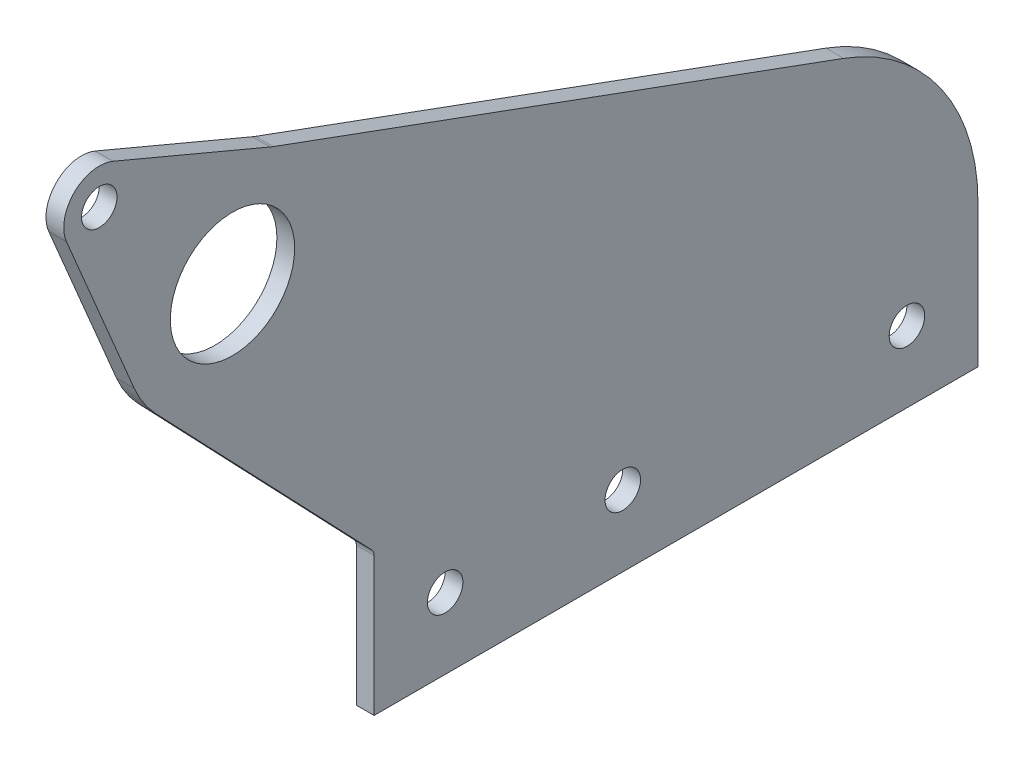
ISO-10303-21;
HEADER;
FILE_DESCRIPTION(('STEP AP214'),'2;1');
FILE_NAME('part.step','',(''),(''),'','','');
FILE_SCHEMA(('AUTOMOTIVE_DESIGN { 1 0 10303 214 1 1 1 1 }'));
ENDSEC;
DATA;
#1=APPLICATION_CONTEXT('core data for automotive mechanical design processes');
#2=APPLICATION_PROTOCOL_DEFINITION('international standard','automotive_design',2000,#1);
#3=PRODUCT_CONTEXT('',#1,'mechanical');
#4=PRODUCT('Part','Part','',(#3));
#5=PRODUCT_RELATED_PRODUCT_CATEGORY('part','',(#4));
#6=PRODUCT_DEFINITION_FORMATION('','',#4);
#7=PRODUCT_DEFINITION_CONTEXT('part definition',#1,'design');
#8=PRODUCT_DEFINITION('design','',#6,#7);
#9=PRODUCT_DEFINITION_SHAPE('','',#8);
#10=(LENGTH_UNIT() NAMED_UNIT(*) SI_UNIT(.MILLI.,.METRE.));
#11=(NAMED_UNIT(*) PLANE_ANGLE_UNIT() SI_UNIT($,.RADIAN.));
#12=(NAMED_UNIT(*) SI_UNIT($,.STERADIAN.) SOLID_ANGLE_UNIT());
#13=UNCERTAINTY_MEASURE_WITH_UNIT(LENGTH_MEASURE(1.E-05),#10,'distance_accuracy_value','');
#14=(GEOMETRIC_REPRESENTATION_CONTEXT(3) GLOBAL_UNCERTAINTY_ASSIGNED_CONTEXT((#13)) GLOBAL_UNIT_ASSIGNED_CONTEXT((#10,
#11,#12)) REPRESENTATION_CONTEXT('',''));
#15=CARTESIAN_POINT('',(0.,0.,0.));
#16=DIRECTION('',(0.,0.,1.));
#17=DIRECTION('',(1.,0.,0.));
#18=AXIS2_PLACEMENT_3D('',#15,#16,#17);
#19=CARTESIAN_POINT('',(-3.175,0.,-177.8));
#20=DIRECTION('',(0.,-1.,0.));
#21=DIRECTION('',(0.,0.,-1.));
#22=AXIS2_PLACEMENT_3D('',#19,#20,#21);
#23=PLANE('',#22);
#24=DIRECTION('',(0.,0.,-1.));
#25=VECTOR('',#24,1.);
#26=CARTESIAN_POINT('',(-3.175,0.,-177.8));
#27=LINE('',#26,#25);
#28=CARTESIAN_POINT('',(-3.175,0.,0.));
#29=VERTEX_POINT('',#28);
#30=CARTESIAN_POINT('',(-3.175,0.,-107.95));
#31=VERTEX_POINT('',#30);
#32=EDGE_CURVE('E143',#29,#31,#27,.T.);
#33=ORIENTED_EDGE('',*,*,#32,.T.);
#34=DIRECTION('',(-1.,0.,0.));
#35=VECTOR('',#34,1.);
#36=CARTESIAN_POINT('',(-3.175,0.,-107.95));
#37=LINE('',#36,#35);
#38=CARTESIAN_POINT('',(0.,0.,-107.95));
#39=VERTEX_POINT('',#38);
#40=EDGE_CURVE('E128',#31,#39,#37,.F.);
#41=ORIENTED_EDGE('',*,*,#40,.T.);
#42=DIRECTION('',(0.,0.,-1.));
#43=VECTOR('',#42,1.);
#44=CARTESIAN_POINT('',(0.,0.,-177.8));
#45=LINE('',#44,#43);
#46=CARTESIAN_POINT('',(0.,0.,0.));
#47=VERTEX_POINT('',#46);
#48=EDGE_CURVE('E141',#47,#39,#45,.T.);
#49=ORIENTED_EDGE('',*,*,#48,.F.);
#50=DIRECTION('',(1.,0.,0.));
#51=VECTOR('',#50,1.);
#52=CARTESIAN_POINT('',(-3.175,0.,0.));
#53=LINE('',#52,#51);
#54=EDGE_CURVE('E166',#29,#47,#53,.T.);
#55=ORIENTED_EDGE('',*,*,#54,.F.);
#56=EDGE_LOOP('',(#33,#41,#49,#55));
#57=FACE_BOUND('',#56,.T.);
#58=ADVANCED_FACE('F38',(#57),#23,.T.);
#59=CARTESIAN_POINT('',(-3.175,79.4625157769409,25.3124843));
#60=DIRECTION('',(1.,0.,0.));
#61=DIRECTION('',(0.,0.,-1.));
#62=AXIS2_PLACEMENT_3D('',#59,#60,#61);
#63=CYLINDRICAL_SURFACE('',#62,19.05);
#64=CARTESIAN_POINT('',(0.,79.4625157769409,25.3124843));
#65=DIRECTION('',(1.,0.,0.));
#66=DIRECTION('',(0.,0.,1.));
#67=AXIS2_PLACEMENT_3D('',#64,#65,#66);
#68=CIRCLE('',#67,19.05);
#69=CARTESIAN_POINT('',(0.,72.0667452596542,42.8682548172867));
#70=VERTEX_POINT('',#69);
#71=CARTESIAN_POINT('',(0.,66.3013876318347,39.085182145669));
#72=VERTEX_POINT('',#71);
#73=EDGE_CURVE('E153',#70,#72,#68,.T.);
#74=ORIENTED_EDGE('',*,*,#73,.F.);
#75=DIRECTION('',(1.,0.,0.));
#76=VECTOR('',#75,1.);
#77=CARTESIAN_POINT('',(-3.175,72.0667452596542,42.8682548172867));
#78=LINE('',#77,#76);
#79=CARTESIAN_POINT('',(-3.175,72.0667452596542,42.8682548172867));
#80=VERTEX_POINT('',#79);
#81=EDGE_CURVE('E209',#80,#70,#78,.T.);
#82=ORIENTED_EDGE('',*,*,#81,.F.);
#83=CARTESIAN_POINT('',(-3.175,79.4625157769409,25.3124843));
#84=DIRECTION('',(1.,0.,0.));
#85=DIRECTION('',(0.,0.,1.));
#86=AXIS2_PLACEMENT_3D('',#83,#84,#85);
#87=CIRCLE('',#86,19.05);
#88=CARTESIAN_POINT('',(-3.175,66.3013876318347,39.085182145669));
#89=VERTEX_POINT('',#88);
#90=EDGE_CURVE('E193',#80,#89,#87,.T.);
#91=ORIENTED_EDGE('',*,*,#90,.T.);
#92=DIRECTION('',(1.,0.,0.));
#93=VECTOR('',#92,1.);
#94=CARTESIAN_POINT('',(-3.175,66.3013876318347,39.085182145669));
#95=LINE('',#94,#93);
#96=EDGE_CURVE('E169',#89,#72,#95,.T.);
#97=ORIENTED_EDGE('',*,*,#96,.T.);
#98=EDGE_LOOP('',(#74,#82,#91,#97));
#99=FACE_BOUND('',#98,.T.);
#100=ADVANCED_FACE('F191',(#99),#63,.T.);
#101=CARTESIAN_POINT('',(-3.175,0.,0.));
#102=DIRECTION('',(0.,0.,1.));
#103=DIRECTION('',(1.,0.,0.));
#104=AXIS2_PLACEMENT_3D('',#101,#102,#103);
#105=PLANE('',#104);
#106=DIRECTION('',(0.,-1.,0.));
#107=VECTOR('',#106,1.);
#108=CARTESIAN_POINT('',(0.,0.,0.));
#109=LINE('',#108,#107);
#110=CARTESIAN_POINT('',(0.,24.7634499202779,0.));
#111=VERTEX_POINT('',#110);
#112=EDGE_CURVE('E148',#111,#47,#109,.T.);
#113=ORIENTED_EDGE('',*,*,#112,.F.);
#114=DIRECTION('',(1.,0.,0.));
#115=VECTOR('',#114,1.);
#116=CARTESIAN_POINT('',(-3.175,24.7634499202779,0.));
#117=LINE('',#116,#115);
#118=CARTESIAN_POINT('',(-3.175,24.7634499202779,0.));
#119=VERTEX_POINT('',#118);
#120=EDGE_CURVE('E53',#111,#119,#117,.F.);
#121=ORIENTED_EDGE('',*,*,#120,.T.);
#122=DIRECTION('',(0.,-1.,0.));
#123=VECTOR('',#122,1.);
#124=CARTESIAN_POINT('',(-3.175,0.,0.));
#125=LINE('',#124,#123);
#126=EDGE_CURVE('E159',#119,#29,#125,.T.);
#127=ORIENTED_EDGE('',*,*,#126,.T.);
#128=ORIENTED_EDGE('',*,*,#54,.T.);
#129=EDGE_LOOP('',(#113,#121,#127,#128));
#130=FACE_BOUND('',#129,.T.);
#131=ADVANCED_FACE('F311',(#130),#105,.T.);
#132=CARTESIAN_POINT('',(-3.175,25.4,0.));
#133=DIRECTION('',(0.,-0.690872868509508,0.722976264864514));
#134=DIRECTION('',(0.,-0.722976264864514,-0.690872868509508));
#135=AXIS2_PLACEMENT_3D('',#132,#133,#134);
#136=PLANE('',#135);
#137=DIRECTION('',(0.,-0.722976264864514,-0.690872868509508));
#138=VECTOR('',#137,1.);
#139=CARTESIAN_POINT('',(-3.175,25.4,0.));
#140=LINE('',#139,#138);
#141=CARTESIAN_POINT('',(-3.175,25.8602105990367,0.439775179527585));
#142=VERTEX_POINT('',#141);
#143=EDGE_CURVE('E181',#89,#142,#140,.T.);
#144=ORIENTED_EDGE('',*,*,#143,.T.);
#145=DIRECTION('',(1.,0.,0.));
#146=VECTOR('',#145,1.);
#147=CARTESIAN_POINT('',(0.,25.8602105990367,0.439775179527585));
#148=LINE('',#147,#146);
#149=CARTESIAN_POINT('',(0.,25.8602105990367,0.439775179527585));
#150=VERTEX_POINT('',#149);
#151=EDGE_CURVE('E168',#142,#150,#148,.T.);
#152=ORIENTED_EDGE('',*,*,#151,.T.);
#153=DIRECTION('',(0.,-0.722976264864514,-0.690872868509508));
#154=VECTOR('',#153,1.);
#155=CARTESIAN_POINT('',(0.,25.4,0.));
#156=LINE('',#155,#154);
#157=EDGE_CURVE('E163',#72,#150,#156,.T.);
#158=ORIENTED_EDGE('',*,*,#157,.F.);
#159=ORIENTED_EDGE('',*,*,#96,.F.);
#160=EDGE_LOOP('',(#144,#152,#158,#159));
#161=FACE_BOUND('',#160,.T.);
#162=ADVANCED_FACE('F178',(#161),#136,.T.);
#163=CARTESIAN_POINT('',(-3.175,97.3516912513575,18.7642096535355));
#164=DIRECTION('',(0.,0.939064329365703,-0.34374145125798));
#165=DIRECTION('',(0.,0.34374145125798,0.939064329365703));
#166=AXIS2_PLACEMENT_3D('',#163,#164,#165);
#167=PLANE('',#166);
#168=DIRECTION('',(-1.,0.,0.));
#169=VECTOR('',#168,1.);
#170=CARTESIAN_POINT('',(-3.175,59.7572730914736,-83.9396596296301));
#171=LINE('',#170,#169);
#172=CARTESIAN_POINT('',(-3.175,59.7572730914736,-83.9396596296301));
#173=VERTEX_POINT('',#172);
#174=CARTESIAN_POINT('',(0.,59.7572730914736,-83.9396596296301));
#175=VERTEX_POINT('',#174);
#176=EDGE_CURVE('E144',#173,#175,#171,.F.);
#177=ORIENTED_EDGE('',*,*,#176,.F.);
#178=DIRECTION('',(0.,0.34374145125798,0.939064329365703));
#179=VECTOR('',#178,1.);
#180=CARTESIAN_POINT('',(-3.175,97.3516912513575,18.7642096535355));
#181=LINE('',#180,#179);
#182=CARTESIAN_POINT('',(-3.175,97.0907402860122,18.0513199442133));
#183=VERTEX_POINT('',#182);
#184=EDGE_CURVE('E199',#173,#183,#181,.T.);
#185=ORIENTED_EDGE('',*,*,#184,.T.);
#186=DIRECTION('',(1.,0.,0.));
#187=VECTOR('',#186,1.);
#188=CARTESIAN_POINT('',(-3.175,97.0907402860122,18.0513199442133));
#189=LINE('',#188,#187);
#190=CARTESIAN_POINT('',(0.,97.0907402860122,18.0513199442133));
#191=VERTEX_POINT('',#190);
#192=EDGE_CURVE('E212',#183,#191,#189,.T.);
#193=ORIENTED_EDGE('',*,*,#192,.T.);
#194=DIRECTION('',(0.,0.34374145125798,0.939064329365703));
#195=VECTOR('',#194,1.);
#196=CARTESIAN_POINT('',(0.,97.3516912513575,18.7642096535355));
#197=LINE('',#196,#195);
#198=EDGE_CURVE('E150',#175,#191,#197,.T.);
#199=ORIENTED_EDGE('',*,*,#198,.F.);
#200=EDGE_LOOP('',(#177,#185,#193,#199));
#201=FACE_BOUND('',#200,.T.);
#202=ADVANCED_FACE('F273',(#201),#167,.T.);
#203=CARTESIAN_POINT('',(-3.175,79.4625157769409,25.3124843));
#204=DIRECTION('',(-1.,0.,0.));
#205=DIRECTION('',(0.,0.,1.));
#206=AXIS2_PLACEMENT_3D('',#203,#204,#205);
#207=PLANE('',#206);
#208=CARTESIAN_POINT('',(-3.175,12.7,-12.7));
#209=DIRECTION('',(-1.,0.,0.));
#210=DIRECTION('',(0.,0.,1.));
#211=AXIS2_PLACEMENT_3D('',#208,#209,#210);
#212=CIRCLE('',#211,3.175);
#213=CARTESIAN_POINT('',(-3.175,12.7,-9.52499999999999));
#214=VERTEX_POINT('',#213);
#215=EDGE_CURVE('E253',#214,#214,#212,.T.);
#216=ORIENTED_EDGE('',*,*,#215,.F.);
#217=EDGE_LOOP('',(#216));
#218=FACE_BOUND('',#217,.T.);
#219=CARTESIAN_POINT('',(-3.175,12.7000000000001,-44.45));
#220=DIRECTION('',(-1.,0.,0.));
#221=DIRECTION('',(0.,0.,1.));
#222=AXIS2_PLACEMENT_3D('',#219,#220,#221);
#223=CIRCLE('',#222,3.175);
#224=CARTESIAN_POINT('',(-3.175,12.7000000000001,-41.275));
#225=VERTEX_POINT('',#224);
#226=EDGE_CURVE('E247',#225,#225,#223,.T.);
#227=ORIENTED_EDGE('',*,*,#226,.F.);
#228=EDGE_LOOP('',(#227));
#229=FACE_BOUND('',#228,.T.);
#230=CARTESIAN_POINT('',(-3.175,12.7,-95.25));
#231=DIRECTION('',(-1.,0.,0.));
#232=DIRECTION('',(0.,0.,1.));
#233=AXIS2_PLACEMENT_3D('',#230,#231,#232);
#234=CIRCLE('',#233,3.175);
#235=CARTESIAN_POINT('',(-3.175,12.7,-92.075));
#236=VERTEX_POINT('',#235);
#237=EDGE_CURVE('E241',#236,#236,#234,.T.);
#238=ORIENTED_EDGE('',*,*,#237,.F.);
#239=EDGE_LOOP('',(#238));
#240=FACE_BOUND('',#239,.T.);
#241=CARTESIAN_POINT('',(-3.175,25.4,-71.3632912761361));
#242=DIRECTION('',(1.,0.,0.));
#243=DIRECTION('',(0.,0.,1.));
#244=AXIS2_PLACEMENT_3D('',#241,#242,#243);
#245=CIRCLE('',#244,36.5867087238639);
#246=CARTESIAN_POINT('',(-3.175,25.4,-107.95));
#247=VERTEX_POINT('',#246);
#248=EDGE_CURVE('E135',#247,#173,#245,.T.);
#249=ORIENTED_EDGE('',*,*,#248,.F.);
#250=DIRECTION('',(0.,1.,0.));
#251=VECTOR('',#250,1.);
#252=CARTESIAN_POINT('',(-3.175,25.4,-107.95));
#253=LINE('',#252,#251);
#254=EDGE_CURVE('E260',#31,#247,#253,.T.);
#255=ORIENTED_EDGE('',*,*,#254,.F.);
#256=ORIENTED_EDGE('',*,*,#32,.F.);
#257=ORIENTED_EDGE('',*,*,#126,.F.);
#258=CARTESIAN_POINT('',(-3.175,24.7634499202779,1.5875));
#259=DIRECTION('',(-1.,0.,0.));
#260=DIRECTION('',(0.,0.,1.));
#261=AXIS2_PLACEMENT_3D('',#258,#259,#260);
#262=CIRCLE('',#261,1.5875);
#263=EDGE_CURVE('E11',#119,#142,#262,.F.);
#264=ORIENTED_EDGE('',*,*,#263,.T.);
#265=ORIENTED_EDGE('',*,*,#143,.F.);
#266=ORIENTED_EDGE('',*,*,#90,.F.);
#267=DIRECTION('',(0.,-0.92156275681295,-0.388229423479616));
#268=VECTOR('',#267,1.);
#269=CARTESIAN_POINT('',(-3.175,100.809758937845,54.9769078057622));
#270=LINE('',#269,#268);
#271=CARTESIAN_POINT('',(-3.175,100.809758937845,54.9769078057622));
#272=VERTEX_POINT('',#271);
#273=EDGE_CURVE('E234',#272,#80,#270,.T.);
#274=ORIENTED_EDGE('',*,*,#273,.F.);
#275=CARTESIAN_POINT('',(-3.175,103.275015776941,49.1249843));
#276=DIRECTION('',(1.,0.,0.));
#277=DIRECTION('',(0.,0.,1.));
#278=AXIS2_PLACEMENT_3D('',#275,#276,#277);
#279=CIRCLE('',#278,6.35);
#280=CARTESIAN_POINT('',(-3.175,109.126939282703,46.6597274609044));
#281=VERTEX_POINT('',#280);
#282=EDGE_CURVE('E221',#281,#272,#279,.T.);
#283=ORIENTED_EDGE('',*,*,#282,.F.);
#284=DIRECTION('',(0.,0.388229423479617,0.92156275681295));
#285=VECTOR('',#284,1.);
#286=CARTESIAN_POINT('',(-3.175,109.126939282703,46.6597274609044));
#287=LINE('',#286,#285);
#288=CARTESIAN_POINT('',(-3.175,97.3130102574322,18.616317191428));
#289=VERTEX_POINT('',#288);
#290=EDGE_CURVE('E210',#289,#281,#287,.T.);
#291=ORIENTED_EDGE('',*,*,#290,.F.);
#292=CARTESIAN_POINT('',(-3.175,109.016857268957,13.6858035132369));
#293=DIRECTION('',(-1.,0.,0.));
#294=DIRECTION('',(0.,0.,-1.));
#295=AXIS2_PLACEMENT_3D('',#292,#293,#294);
#296=CIRCLE('',#295,12.7);
#297=EDGE_CURVE('E231',#183,#289,#296,.T.);
#298=ORIENTED_EDGE('',*,*,#297,.F.);
#299=ORIENTED_EDGE('',*,*,#184,.F.);
#300=EDGE_LOOP('',(#249,#255,#256,#257,#264,#265,#266,#274,#283,#291,#298,#299));
#301=FACE_BOUND('',#300,.T.);
#302=CARTESIAN_POINT('',(-3.175,79.4625157769409,25.3124843));
#303=DIRECTION('',(1.,0.,0.));
#304=DIRECTION('',(0.,0.,-1.));
#305=AXIS2_PLACEMENT_3D('',#302,#303,#304);
#306=CIRCLE('',#305,11.1125);
#307=CARTESIAN_POINT('',(-3.175,79.4625157769409,14.1999843));
#308=VERTEX_POINT('',#307);
#309=EDGE_CURVE('E151',#308,#308,#306,.T.);
#310=ORIENTED_EDGE('',*,*,#309,.T.);
#311=EDGE_LOOP('',(#310));
#312=FACE_BOUND('',#311,.T.);
#313=CARTESIAN_POINT('',(-3.175,103.275015776941,49.1249843));
#314=DIRECTION('',(1.,0.,0.));
#315=DIRECTION('',(0.,0.,-1.));
#316=AXIS2_PLACEMENT_3D('',#313,#314,#315);
#317=CIRCLE('',#316,3.175);
#318=CARTESIAN_POINT('',(-3.175,103.275015776941,45.9499843));
#319=VERTEX_POINT('',#318);
#320=EDGE_CURVE('E228',#319,#319,#317,.T.);
#321=ORIENTED_EDGE('',*,*,#320,.T.);
#322=EDGE_LOOP('',(#321));
#323=FACE_BOUND('',#322,.T.);
#324=ADVANCED_FACE('F196',(#218,#229,#240,#301,#312,#323),#207,.T.);
#325=CARTESIAN_POINT('',(0.,79.4625157769409,25.3124843));
#326=DIRECTION('',(-1.,0.,0.));
#327=DIRECTION('',(0.,0.,1.));
#328=AXIS2_PLACEMENT_3D('',#325,#326,#327);
#329=PLANE('',#328);
#330=DIRECTION('',(0.,1.,0.));
#331=VECTOR('',#330,1.);
#332=CARTESIAN_POINT('',(0.,79.4625157769409,-107.95));
#333=LINE('',#332,#331);
#334=CARTESIAN_POINT('',(0.,25.4,-107.95));
#335=VERTEX_POINT('',#334);
#336=EDGE_CURVE('E125',#39,#335,#333,.T.);
#337=ORIENTED_EDGE('',*,*,#336,.T.);
#338=CARTESIAN_POINT('',(0.,25.4,-71.3632912761361));
#339=DIRECTION('',(1.,0.,0.));
#340=DIRECTION('',(0.,0.,-1.));
#341=AXIS2_PLACEMENT_3D('',#338,#339,#340);
#342=CIRCLE('',#341,36.5867087238639);
#343=EDGE_CURVE('E134',#335,#175,#342,.T.);
#344=ORIENTED_EDGE('',*,*,#343,.T.);
#345=ORIENTED_EDGE('',*,*,#198,.T.);
#346=CARTESIAN_POINT('',(0.,109.016857268957,13.6858035132369));
#347=DIRECTION('',(-1.,0.,0.));
#348=DIRECTION('',(0.,0.,-1.));
#349=AXIS2_PLACEMENT_3D('',#346,#347,#348);
#350=CIRCLE('',#349,12.7);
#351=CARTESIAN_POINT('',(0.,97.3130102574322,18.616317191428));
#352=VERTEX_POINT('',#351);
#353=EDGE_CURVE('E222',#191,#352,#350,.T.);
#354=ORIENTED_EDGE('',*,*,#353,.T.);
#355=DIRECTION('',(0.,0.388229423479617,0.92156275681295));
#356=VECTOR('',#355,1.);
#357=CARTESIAN_POINT('',(0.,109.126939282703,46.6597274609044));
#358=LINE('',#357,#356);
#359=CARTESIAN_POINT('',(0.,109.126939282703,46.6597274609044));
#360=VERTEX_POINT('',#359);
#361=EDGE_CURVE('E218',#352,#360,#358,.T.);
#362=ORIENTED_EDGE('',*,*,#361,.T.);
#363=CARTESIAN_POINT('',(0.,103.275015776941,49.1249843));
#364=DIRECTION('',(1.,0.,0.));
#365=DIRECTION('',(0.,0.,1.));
#366=AXIS2_PLACEMENT_3D('',#363,#364,#365);
#367=CIRCLE('',#366,6.35);
#368=CARTESIAN_POINT('',(0.,100.809758937845,54.9769078057622));
#369=VERTEX_POINT('',#368);
#370=EDGE_CURVE('E226',#360,#369,#367,.T.);
#371=ORIENTED_EDGE('',*,*,#370,.T.);
#372=DIRECTION('',(0.,-0.92156275681295,-0.388229423479616));
#373=VECTOR('',#372,1.);
#374=CARTESIAN_POINT('',(0.,100.809758937845,54.9769078057622));
#375=LINE('',#374,#373);
#376=EDGE_CURVE('E187',#369,#70,#375,.T.);
#377=ORIENTED_EDGE('',*,*,#376,.T.);
#378=ORIENTED_EDGE('',*,*,#73,.T.);
#379=ORIENTED_EDGE('',*,*,#157,.T.);
#380=CARTESIAN_POINT('',(0.,24.7634499202779,1.5875));
#381=DIRECTION('',(-1.,0.,0.));
#382=DIRECTION('',(0.,0.,1.));
#383=AXIS2_PLACEMENT_3D('',#380,#381,#382);
#384=CIRCLE('',#383,1.5875);
#385=EDGE_CURVE('E46',#150,#111,#384,.T.);
#386=ORIENTED_EDGE('',*,*,#385,.T.);
#387=ORIENTED_EDGE('',*,*,#112,.T.);
#388=ORIENTED_EDGE('',*,*,#48,.T.);
#389=EDGE_LOOP('',(#337,#344,#345,#354,#362,#371,#377,#378,#379,#386,#387,#388));
#390=FACE_BOUND('',#389,.T.);
#391=CARTESIAN_POINT('',(0.,12.7,-12.7));
#392=DIRECTION('',(-1.,0.,0.));
#393=DIRECTION('',(0.,0.,1.));
#394=AXIS2_PLACEMENT_3D('',#391,#392,#393);
#395=CIRCLE('',#394,3.175);
#396=CARTESIAN_POINT('',(0.,12.7,-9.52499999999999));
#397=VERTEX_POINT('',#396);
#398=EDGE_CURVE('E257',#397,#397,#395,.T.);
#399=ORIENTED_EDGE('',*,*,#398,.T.);
#400=EDGE_LOOP('',(#399));
#401=FACE_BOUND('',#400,.T.);
#402=CARTESIAN_POINT('',(0.,12.7000000000001,-44.45));
#403=DIRECTION('',(-1.,0.,0.));
#404=DIRECTION('',(0.,0.,1.));
#405=AXIS2_PLACEMENT_3D('',#402,#403,#404);
#406=CIRCLE('',#405,3.175);
#407=CARTESIAN_POINT('',(0.,12.7000000000001,-41.275));
#408=VERTEX_POINT('',#407);
#409=EDGE_CURVE('E250',#408,#408,#406,.T.);
#410=ORIENTED_EDGE('',*,*,#409,.T.);
#411=EDGE_LOOP('',(#410));
#412=FACE_BOUND('',#411,.T.);
#413=CARTESIAN_POINT('',(0.,12.7,-95.25));
#414=DIRECTION('',(-1.,0.,0.));
#415=DIRECTION('',(0.,0.,1.));
#416=AXIS2_PLACEMENT_3D('',#413,#414,#415);
#417=CIRCLE('',#416,3.175);
#418=CARTESIAN_POINT('',(0.,12.7,-92.075));
#419=VERTEX_POINT('',#418);
#420=EDGE_CURVE('E244',#419,#419,#417,.T.);
#421=ORIENTED_EDGE('',*,*,#420,.T.);
#422=EDGE_LOOP('',(#421));
#423=FACE_BOUND('',#422,.T.);
#424=CARTESIAN_POINT('',(0.,79.4625157769409,25.3124843));
#425=DIRECTION('',(1.,0.,0.));
#426=DIRECTION('',(0.,0.,-1.));
#427=AXIS2_PLACEMENT_3D('',#424,#425,#426);
#428=CIRCLE('',#427,11.1125);
#429=CARTESIAN_POINT('',(0.,79.4625157769409,14.1999843));
#430=VERTEX_POINT('',#429);
#431=EDGE_CURVE('E156',#430,#430,#428,.T.);
#432=ORIENTED_EDGE('',*,*,#431,.F.);
#433=EDGE_LOOP('',(#432));
#434=FACE_BOUND('',#433,.T.);
#435=CARTESIAN_POINT('',(0.,103.275015776941,49.1249843));
#436=DIRECTION('',(1.,0.,0.));
#437=DIRECTION('',(0.,0.,-1.));
#438=AXIS2_PLACEMENT_3D('',#435,#436,#437);
#439=CIRCLE('',#438,3.175);
#440=CARTESIAN_POINT('',(0.,103.275015776941,45.9499843));
#441=VERTEX_POINT('',#440);
#442=EDGE_CURVE('E238',#441,#441,#439,.T.);
#443=ORIENTED_EDGE('',*,*,#442,.F.);
#444=EDGE_LOOP('',(#443));
#445=FACE_BOUND('',#444,.T.);
#446=ADVANCED_FACE('F146',(#390,#401,#412,#423,#434,#445),#329,.F.);
#447=CARTESIAN_POINT('',(-3.175,79.4625157769409,25.3124843));
#448=DIRECTION('',(1.,0.,0.));
#449=DIRECTION('',(0.,0.,-1.));
#450=AXIS2_PLACEMENT_3D('',#447,#448,#449);
#451=CYLINDRICAL_SURFACE('',#450,11.1125);
#452=ORIENTED_EDGE('',*,*,#309,.F.);
#453=EDGE_LOOP('',(#452));
#454=FACE_BOUND('',#453,.T.);
#455=ORIENTED_EDGE('',*,*,#431,.T.);
#456=EDGE_LOOP('',(#455));
#457=FACE_BOUND('',#456,.T.);
#458=ADVANCED_FACE('F289',(#454,#457),#451,.F.);
#459=CARTESIAN_POINT('',(-3.175,103.275015776941,49.1249843));
#460=DIRECTION('',(1.,0.,0.));
#461=DIRECTION('',(0.,0.,-1.));
#462=AXIS2_PLACEMENT_3D('',#459,#460,#461);
#463=CYLINDRICAL_SURFACE('',#462,6.35);
#464=ORIENTED_EDGE('',*,*,#370,.F.);
#465=DIRECTION('',(1.,0.,0.));
#466=VECTOR('',#465,1.);
#467=CARTESIAN_POINT('',(-3.175,109.126939282703,46.6597274609044));
#468=LINE('',#467,#466);
#469=EDGE_CURVE('E205',#281,#360,#468,.T.);
#470=ORIENTED_EDGE('',*,*,#469,.F.);
#471=ORIENTED_EDGE('',*,*,#282,.T.);
#472=DIRECTION('',(1.,0.,0.));
#473=VECTOR('',#472,1.);
#474=CARTESIAN_POINT('',(-3.175,100.809758937845,54.9769078057622));
#475=LINE('',#474,#473);
#476=EDGE_CURVE('E207',#272,#369,#475,.T.);
#477=ORIENTED_EDGE('',*,*,#476,.T.);
#478=EDGE_LOOP('',(#464,#470,#471,#477));
#479=FACE_BOUND('',#478,.T.);
#480=ADVANCED_FACE('F323',(#479),#463,.T.);
#481=CARTESIAN_POINT('',(-3.175,109.126939282703,46.6597274609044));
#482=DIRECTION('',(0.,0.92156275681295,-0.388229423479617));
#483=DIRECTION('',(0.,0.388229423479617,0.92156275681295));
#484=AXIS2_PLACEMENT_3D('',#481,#482,#483);
#485=PLANE('',#484);
#486=ORIENTED_EDGE('',*,*,#361,.F.);
#487=DIRECTION('',(1.,0.,0.));
#488=VECTOR('',#487,1.);
#489=CARTESIAN_POINT('',(-3.175,97.3130102574322,18.616317191428));
#490=LINE('',#489,#488);
#491=EDGE_CURVE('E215',#289,#352,#490,.T.);
#492=ORIENTED_EDGE('',*,*,#491,.F.);
#493=ORIENTED_EDGE('',*,*,#290,.T.);
#494=ORIENTED_EDGE('',*,*,#469,.T.);
#495=EDGE_LOOP('',(#486,#492,#493,#494));
#496=FACE_BOUND('',#495,.T.);
#497=ADVANCED_FACE('F326',(#496),#485,.T.);
#498=CARTESIAN_POINT('',(-3.175,109.016857268957,13.6858035132369));
#499=DIRECTION('',(1.,0.,0.));
#500=DIRECTION('',(0.,0.,-1.));
#501=AXIS2_PLACEMENT_3D('',#498,#499,#500);
#502=CYLINDRICAL_SURFACE('',#501,12.7);
#503=ORIENTED_EDGE('',*,*,#353,.F.);
#504=ORIENTED_EDGE('',*,*,#192,.F.);
#505=ORIENTED_EDGE('',*,*,#297,.T.);
#506=ORIENTED_EDGE('',*,*,#491,.T.);
#507=EDGE_LOOP('',(#503,#504,#505,#506));
#508=FACE_BOUND('',#507,.T.);
#509=ADVANCED_FACE('F302',(#508),#502,.F.);
#510=CARTESIAN_POINT('',(-3.175,100.809758937845,54.9769078057622));
#511=DIRECTION('',(0.,-0.388229423479616,0.92156275681295));
#512=DIRECTION('',(0.,-0.92156275681295,-0.388229423479616));
#513=AXIS2_PLACEMENT_3D('',#510,#511,#512);
#514=PLANE('',#513);
#515=ORIENTED_EDGE('',*,*,#376,.F.);
#516=ORIENTED_EDGE('',*,*,#476,.F.);
#517=ORIENTED_EDGE('',*,*,#273,.T.);
#518=ORIENTED_EDGE('',*,*,#81,.T.);
#519=EDGE_LOOP('',(#515,#516,#517,#518));
#520=FACE_BOUND('',#519,.T.);
#521=ADVANCED_FACE('F296',(#520),#514,.T.);
#522=CARTESIAN_POINT('',(-3.175,103.275015776941,49.1249843));
#523=DIRECTION('',(1.,0.,0.));
#524=DIRECTION('',(0.,0.,-1.));
#525=AXIS2_PLACEMENT_3D('',#522,#523,#524);
#526=CYLINDRICAL_SURFACE('',#525,3.175);
#527=ORIENTED_EDGE('',*,*,#320,.F.);
#528=EDGE_LOOP('',(#527));
#529=FACE_BOUND('',#528,.T.);
#530=ORIENTED_EDGE('',*,*,#442,.T.);
#531=EDGE_LOOP('',(#530));
#532=FACE_BOUND('',#531,.T.);
#533=ADVANCED_FACE('F283',(#529,#532),#526,.F.);
#534=CARTESIAN_POINT('',(0.,12.7,-95.25));
#535=DIRECTION('',(-1.,0.,0.));
#536=DIRECTION('',(0.,0.,1.));
#537=AXIS2_PLACEMENT_3D('',#534,#535,#536);
#538=CYLINDRICAL_SURFACE('',#537,3.175);
#539=ORIENTED_EDGE('',*,*,#237,.T.);
#540=EDGE_LOOP('',(#539));
#541=FACE_BOUND('',#540,.T.);
#542=ORIENTED_EDGE('',*,*,#420,.F.);
#543=EDGE_LOOP('',(#542));
#544=FACE_BOUND('',#543,.T.);
#545=ADVANCED_FACE('F279',(#541,#544),#538,.F.);
#546=CARTESIAN_POINT('',(0.,12.7000000000001,-44.45));
#547=DIRECTION('',(-1.,0.,0.));
#548=DIRECTION('',(0.,0.,1.));
#549=AXIS2_PLACEMENT_3D('',#546,#547,#548);
#550=CYLINDRICAL_SURFACE('',#549,3.175);
#551=ORIENTED_EDGE('',*,*,#226,.T.);
#552=EDGE_LOOP('',(#551));
#553=FACE_BOUND('',#552,.T.);
#554=ORIENTED_EDGE('',*,*,#409,.F.);
#555=EDGE_LOOP('',(#554));
#556=FACE_BOUND('',#555,.T.);
#557=ADVANCED_FACE('F282',(#553,#556),#550,.F.);
#558=CARTESIAN_POINT('',(0.,12.7,-12.7));
#559=DIRECTION('',(-1.,0.,0.));
#560=DIRECTION('',(0.,0.,1.));
#561=AXIS2_PLACEMENT_3D('',#558,#559,#560);
#562=CYLINDRICAL_SURFACE('',#561,3.175);
#563=ORIENTED_EDGE('',*,*,#215,.T.);
#564=EDGE_LOOP('',(#563));
#565=FACE_BOUND('',#564,.T.);
#566=ORIENTED_EDGE('',*,*,#398,.F.);
#567=EDGE_LOOP('',(#566));
#568=FACE_BOUND('',#567,.T.);
#569=ADVANCED_FACE('F268',(#565,#568),#562,.F.);
#570=CARTESIAN_POINT('',(-3.175,25.4,-107.95));
#571=DIRECTION('',(0.,0.,1.));
#572=DIRECTION('',(0.,1.,0.));
#573=AXIS2_PLACEMENT_3D('',#570,#571,#572);
#574=PLANE('',#573);
#575=ORIENTED_EDGE('',*,*,#40,.F.);
#576=ORIENTED_EDGE('',*,*,#254,.T.);
#577=DIRECTION('',(-1.,0.,0.));
#578=VECTOR('',#577,1.);
#579=CARTESIAN_POINT('',(-3.175,25.4,-107.95));
#580=LINE('',#579,#578);
#581=EDGE_CURVE('E131',#247,#335,#580,.F.);
#582=ORIENTED_EDGE('',*,*,#581,.T.);
#583=ORIENTED_EDGE('',*,*,#336,.F.);
#584=EDGE_LOOP('',(#575,#576,#582,#583));
#585=FACE_BOUND('',#584,.T.);
#586=ADVANCED_FACE('F127',(#585),#574,.F.);
#587=CARTESIAN_POINT('',(-3.175,25.4,-71.3632912761361));
#588=DIRECTION('',(1.,0.,0.));
#589=DIRECTION('',(0.,0.,-1.));
#590=AXIS2_PLACEMENT_3D('',#587,#588,#589);
#591=CYLINDRICAL_SURFACE('',#590,36.5867087238639);
#592=ORIENTED_EDGE('',*,*,#248,.T.);
#593=ORIENTED_EDGE('',*,*,#176,.T.);
#594=ORIENTED_EDGE('',*,*,#343,.F.);
#595=ORIENTED_EDGE('',*,*,#581,.F.);
#596=EDGE_LOOP('',(#592,#593,#594,#595));
#597=FACE_BOUND('',#596,.T.);
#598=ADVANCED_FACE('F346',(#597),#591,.T.);
#599=CARTESIAN_POINT('',(-3.175,24.7634499202779,1.5875));
#600=DIRECTION('',(-1.,0.,0.));
#601=DIRECTION('',(0.,0.,1.));
#602=AXIS2_PLACEMENT_3D('',#599,#600,#601);
#603=CYLINDRICAL_SURFACE('',#602,1.5875);
#604=ORIENTED_EDGE('',*,*,#263,.F.);
#605=ORIENTED_EDGE('',*,*,#120,.F.);
#606=ORIENTED_EDGE('',*,*,#385,.F.);
#607=ORIENTED_EDGE('',*,*,#151,.F.);
#608=EDGE_LOOP('',(#604,#605,#606,#607));
#609=FACE_BOUND('',#608,.T.);
#610=ADVANCED_FACE('F40',(#609),#603,.F.);
#611=CLOSED_SHELL('',(#58,#100,#131,#162,#202,#324,#446,#458,#480,#497,#509,#521,#533,#545,#557,
#569,#586,#598,#610));
#612=MANIFOLD_SOLID_BREP('B2',#611);
#613=ADVANCED_BREP_SHAPE_REPRESENTATION('',(#18,#612),#14);
#614=SHAPE_DEFINITION_REPRESENTATION(#9,#613);
ENDSEC;
END-ISO-10303-21;
